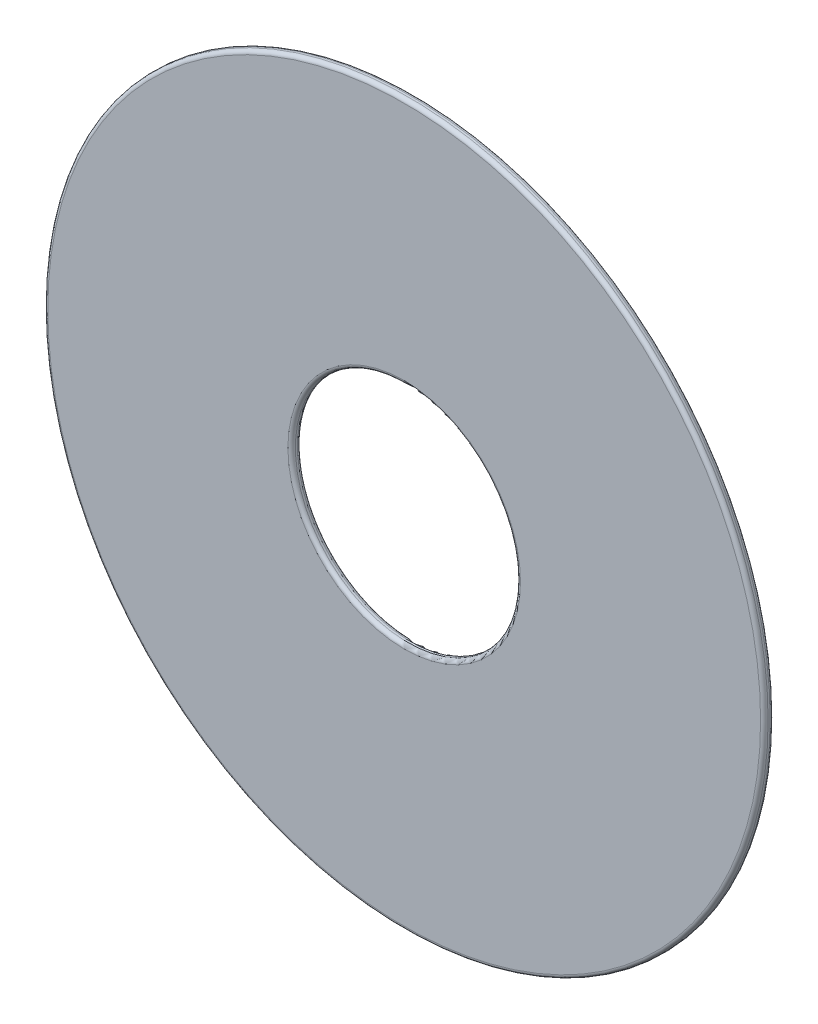
ISO-10303-21;
HEADER;
FILE_DESCRIPTION(('STEP AP214'),'2;1');
FILE_NAME('part.step','',(''),(''),'','','');
FILE_SCHEMA(('AUTOMOTIVE_DESIGN { 1 0 10303 214 1 1 1 1 }'));
ENDSEC;
DATA;
#1=APPLICATION_CONTEXT('core data for automotive mechanical design processes');
#2=APPLICATION_PROTOCOL_DEFINITION('international standard','automotive_design',2000,#1);
#3=PRODUCT_CONTEXT('',#1,'mechanical');
#4=PRODUCT('Part','Part','',(#3));
#5=PRODUCT_RELATED_PRODUCT_CATEGORY('part','',(#4));
#6=PRODUCT_DEFINITION_FORMATION('','',#4);
#7=PRODUCT_DEFINITION_CONTEXT('part definition',#1,'design');
#8=PRODUCT_DEFINITION('design','',#6,#7);
#9=PRODUCT_DEFINITION_SHAPE('','',#8);
#10=(LENGTH_UNIT() NAMED_UNIT(*) SI_UNIT(.MILLI.,.METRE.));
#11=(NAMED_UNIT(*) PLANE_ANGLE_UNIT() SI_UNIT($,.RADIAN.));
#12=(NAMED_UNIT(*) SI_UNIT($,.STERADIAN.) SOLID_ANGLE_UNIT());
#13=UNCERTAINTY_MEASURE_WITH_UNIT(LENGTH_MEASURE(1.E-05),#10,'distance_accuracy_value','');
#14=(GEOMETRIC_REPRESENTATION_CONTEXT(3) GLOBAL_UNCERTAINTY_ASSIGNED_CONTEXT((#13)) GLOBAL_UNIT_ASSIGNED_CONTEXT((#10,
#11,#12)) REPRESENTATION_CONTEXT('',''));
#15=CARTESIAN_POINT('',(0.,0.,0.));
#16=DIRECTION('',(0.,0.,1.));
#17=DIRECTION('',(1.,0.,0.));
#18=AXIS2_PLACEMENT_3D('',#15,#16,#17);
#19=CARTESIAN_POINT('',(0.,0.,0.64));
#20=DIRECTION('',(0.,0.,1.));
#21=DIRECTION('',(1.,0.,0.));
#22=AXIS2_PLACEMENT_3D('',#19,#20,#21);
#23=PLANE('',#22);
#24=CARTESIAN_POINT('',(0.,0.,0.64));
#25=DIRECTION('',(0.,0.,1.));
#26=DIRECTION('',(1.,0.,0.));
#27=AXIS2_PLACEMENT_3D('',#24,#25,#26);
#28=CIRCLE('',#27,7.75000000000001);
#29=CARTESIAN_POINT('',(7.75000000000001,0.,0.64));
#30=VERTEX_POINT('',#29);
#31=EDGE_CURVE('E49',#30,#30,#28,.F.);
#32=ORIENTED_EDGE('',*,*,#31,.T.);
#33=EDGE_LOOP('',(#32));
#34=FACE_BOUND('',#33,.T.);
#35=CARTESIAN_POINT('',(0.,0.,0.64));
#36=DIRECTION('',(0.,0.,1.));
#37=DIRECTION('',(1.,0.,0.));
#38=AXIS2_PLACEMENT_3D('',#35,#36,#37);
#39=CIRCLE('',#38,23.75);
#40=CARTESIAN_POINT('',(23.75,0.,0.64));
#41=VERTEX_POINT('',#40);
#42=EDGE_CURVE('E54',#41,#41,#39,.T.);
#43=ORIENTED_EDGE('',*,*,#42,.T.);
#44=EDGE_LOOP('',(#43));
#45=FACE_BOUND('',#44,.T.);
#46=ADVANCED_FACE('F36',(#34,#45),#23,.T.);
#47=CARTESIAN_POINT('',(0.,0.,0.));
#48=DIRECTION('',(0.,0.,1.));
#49=DIRECTION('',(1.,0.,0.));
#50=AXIS2_PLACEMENT_3D('',#47,#48,#49);
#51=PLANE('',#50);
#52=CARTESIAN_POINT('',(0.,0.,0.));
#53=DIRECTION('',(0.,0.,1.));
#54=DIRECTION('',(1.,0.,0.));
#55=AXIS2_PLACEMENT_3D('',#52,#53,#54);
#56=CIRCLE('',#55,7.75000000000001);
#57=CARTESIAN_POINT('',(7.75000000000001,0.,0.));
#58=VERTEX_POINT('',#57);
#59=EDGE_CURVE('E68',#58,#58,#56,.T.);
#60=ORIENTED_EDGE('',*,*,#59,.T.);
#61=EDGE_LOOP('',(#60));
#62=FACE_BOUND('',#61,.T.);
#63=CARTESIAN_POINT('',(0.,0.,0.));
#64=DIRECTION('',(0.,0.,1.));
#65=DIRECTION('',(1.,0.,0.));
#66=AXIS2_PLACEMENT_3D('',#63,#64,#65);
#67=CIRCLE('',#66,23.75);
#68=CARTESIAN_POINT('',(23.75,0.,0.));
#69=VERTEX_POINT('',#68);
#70=EDGE_CURVE('E72',#69,#69,#67,.F.);
#71=ORIENTED_EDGE('',*,*,#70,.T.);
#72=EDGE_LOOP('',(#71));
#73=FACE_BOUND('',#72,.T.);
#74=ADVANCED_FACE('F77',(#62,#73),#51,.F.);
#75=CARTESIAN_POINT('',(0.,0.,0.64));
#76=DIRECTION('',(0.,0.,-1.));
#77=DIRECTION('',(-1.,0.,0.));
#78=AXIS2_PLACEMENT_3D('',#75,#76,#77);
#79=CYLINDRICAL_SURFACE('',#78,24.);
#80=CARTESIAN_POINT('',(0.,0.,0.25));
#81=DIRECTION('',(0.,0.,1.));
#82=DIRECTION('',(1.,0.,0.));
#83=AXIS2_PLACEMENT_3D('',#80,#81,#82);
#84=CIRCLE('',#83,24.);
#85=CARTESIAN_POINT('',(24.,0.,0.25));
#86=VERTEX_POINT('',#85);
#87=EDGE_CURVE('E10',#86,#86,#84,.T.);
#88=ORIENTED_EDGE('',*,*,#87,.T.);
#89=EDGE_LOOP('',(#88));
#90=FACE_BOUND('',#89,.T.);
#91=CARTESIAN_POINT('',(0.,0.,0.39));
#92=DIRECTION('',(0.,0.,1.));
#93=DIRECTION('',(1.,0.,0.));
#94=AXIS2_PLACEMENT_3D('',#91,#92,#93);
#95=CIRCLE('',#94,24.);
#96=CARTESIAN_POINT('',(24.,0.,0.39));
#97=VERTEX_POINT('',#96);
#98=EDGE_CURVE('E44',#97,#97,#95,.F.);
#99=ORIENTED_EDGE('',*,*,#98,.T.);
#100=EDGE_LOOP('',(#99));
#101=FACE_BOUND('',#100,.T.);
#102=ADVANCED_FACE('F97',(#90,#101),#79,.T.);
#103=CARTESIAN_POINT('',(0.,0.,0.64));
#104=DIRECTION('',(0.,0.,-1.));
#105=DIRECTION('',(-1.,0.,0.));
#106=AXIS2_PLACEMENT_3D('',#103,#104,#105);
#107=CYLINDRICAL_SURFACE('',#106,7.50000000000001);
#108=CARTESIAN_POINT('',(0.,0.,0.25));
#109=DIRECTION('',(0.,0.,1.));
#110=DIRECTION('',(1.,0.,0.));
#111=AXIS2_PLACEMENT_3D('',#108,#109,#110);
#112=CIRCLE('',#111,7.50000000000001);
#113=CARTESIAN_POINT('',(7.50000000000001,0.,0.25));
#114=VERTEX_POINT('',#113);
#115=EDGE_CURVE('E60',#114,#114,#112,.F.);
#116=ORIENTED_EDGE('',*,*,#115,.T.);
#117=EDGE_LOOP('',(#116));
#118=FACE_BOUND('',#117,.T.);
#119=CARTESIAN_POINT('',(0.,0.,0.39));
#120=DIRECTION('',(0.,0.,1.));
#121=DIRECTION('',(1.,0.,0.));
#122=AXIS2_PLACEMENT_3D('',#119,#120,#121);
#123=CIRCLE('',#122,7.50000000000001);
#124=CARTESIAN_POINT('',(7.50000000000001,0.,0.39));
#125=VERTEX_POINT('',#124);
#126=EDGE_CURVE('E64',#125,#125,#123,.T.);
#127=ORIENTED_EDGE('',*,*,#126,.T.);
#128=EDGE_LOOP('',(#127));
#129=FACE_BOUND('',#128,.T.);
#130=ADVANCED_FACE('F102',(#118,#129),#107,.F.);
#131=CARTESIAN_POINT('',(0.,0.,0.25));
#132=DIRECTION('',(0.,0.,1.));
#133=DIRECTION('',(1.,0.,0.));
#134=AXIS2_PLACEMENT_3D('',#131,#132,#133);
#135=TOROIDAL_SURFACE('',#134,7.75000000000001,0.25);
#136=ORIENTED_EDGE('',*,*,#115,.F.);
#137=EDGE_LOOP('',(#136));
#138=FACE_BOUND('',#137,.T.);
#139=ORIENTED_EDGE('',*,*,#59,.F.);
#140=EDGE_LOOP('',(#139));
#141=FACE_BOUND('',#140,.T.);
#142=ADVANCED_FACE('F88',(#138,#141),#135,.T.);
#143=CARTESIAN_POINT('',(0.,0.,0.39));
#144=DIRECTION('',(0.,0.,1.));
#145=DIRECTION('',(1.,0.,0.));
#146=AXIS2_PLACEMENT_3D('',#143,#144,#145);
#147=TOROIDAL_SURFACE('',#146,7.75000000000001,0.25);
#148=ORIENTED_EDGE('',*,*,#31,.F.);
#149=EDGE_LOOP('',(#148));
#150=FACE_BOUND('',#149,.T.);
#151=ORIENTED_EDGE('',*,*,#126,.F.);
#152=EDGE_LOOP('',(#151));
#153=FACE_BOUND('',#152,.T.);
#154=ADVANCED_FACE('F82',(#150,#153),#147,.T.);
#155=CARTESIAN_POINT('',(0.,0.,0.25));
#156=DIRECTION('',(0.,0.,1.));
#157=DIRECTION('',(1.,0.,0.));
#158=AXIS2_PLACEMENT_3D('',#155,#156,#157);
#159=TOROIDAL_SURFACE('',#158,23.75,0.25);
#160=ORIENTED_EDGE('',*,*,#70,.F.);
#161=EDGE_LOOP('',(#160));
#162=FACE_BOUND('',#161,.T.);
#163=ORIENTED_EDGE('',*,*,#87,.F.);
#164=EDGE_LOOP('',(#163));
#165=FACE_BOUND('',#164,.T.);
#166=ADVANCED_FACE('F79',(#162,#165),#159,.T.);
#167=CARTESIAN_POINT('',(0.,0.,0.39));
#168=DIRECTION('',(0.,0.,1.));
#169=DIRECTION('',(1.,0.,0.));
#170=AXIS2_PLACEMENT_3D('',#167,#168,#169);
#171=TOROIDAL_SURFACE('',#170,23.75,0.25);
#172=ORIENTED_EDGE('',*,*,#98,.F.);
#173=EDGE_LOOP('',(#172));
#174=FACE_BOUND('',#173,.T.);
#175=ORIENTED_EDGE('',*,*,#42,.F.);
#176=EDGE_LOOP('',(#175));
#177=FACE_BOUND('',#176,.T.);
#178=ADVANCED_FACE('F38',(#174,#177),#171,.T.);
#179=CLOSED_SHELL('',(#46,#74,#102,#130,#142,#154,#166,#178));
#180=MANIFOLD_SOLID_BREP('B2',#179);
#181=ADVANCED_BREP_SHAPE_REPRESENTATION('',(#18,#180),#14);
#182=SHAPE_DEFINITION_REPRESENTATION(#9,#181);
ENDSEC;
END-ISO-10303-21;
